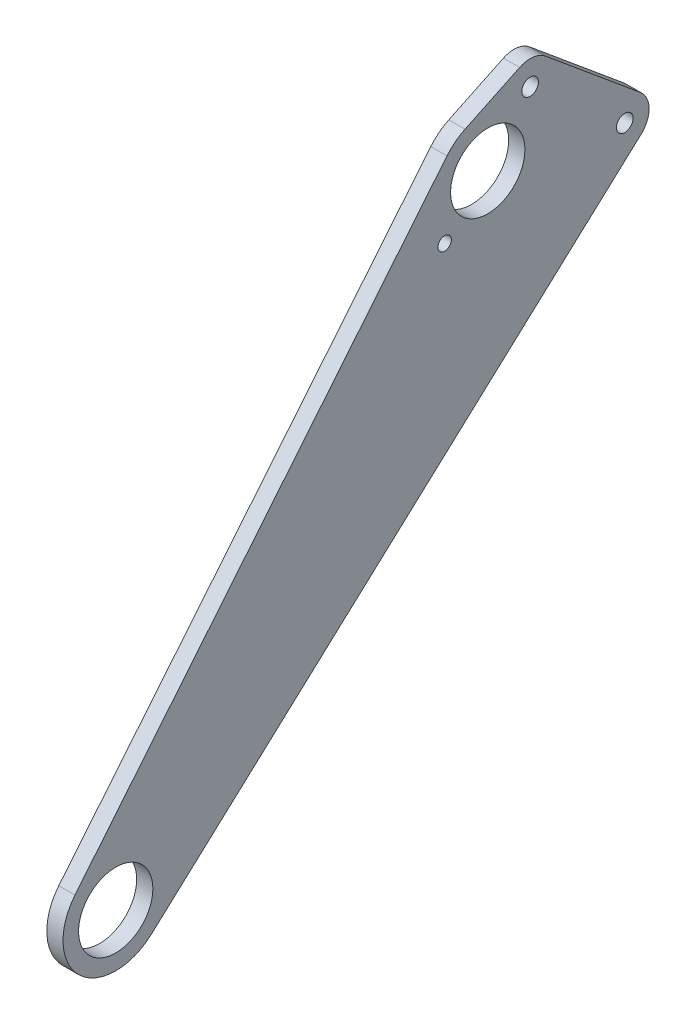
ISO-10303-21;
HEADER;
FILE_DESCRIPTION(('STEP AP214'),'2;1');
FILE_NAME('part.step','',(''),(''),'','','');
FILE_SCHEMA(('AUTOMOTIVE_DESIGN { 1 0 10303 214 1 1 1 1 }'));
ENDSEC;
DATA;
#1=APPLICATION_CONTEXT('core data for automotive mechanical design processes');
#2=APPLICATION_PROTOCOL_DEFINITION('international standard','automotive_design',2000,#1);
#3=PRODUCT_CONTEXT('',#1,'mechanical');
#4=PRODUCT('Part','Part','',(#3));
#5=PRODUCT_RELATED_PRODUCT_CATEGORY('part','',(#4));
#6=PRODUCT_DEFINITION_FORMATION('','',#4);
#7=PRODUCT_DEFINITION_CONTEXT('part definition',#1,'design');
#8=PRODUCT_DEFINITION('design','',#6,#7);
#9=PRODUCT_DEFINITION_SHAPE('','',#8);
#10=(LENGTH_UNIT() NAMED_UNIT(*) SI_UNIT(.MILLI.,.METRE.));
#11=(NAMED_UNIT(*) PLANE_ANGLE_UNIT() SI_UNIT($,.RADIAN.));
#12=(NAMED_UNIT(*) SI_UNIT($,.STERADIAN.) SOLID_ANGLE_UNIT());
#13=UNCERTAINTY_MEASURE_WITH_UNIT(LENGTH_MEASURE(1.E-05),#10,'distance_accuracy_value','');
#14=(GEOMETRIC_REPRESENTATION_CONTEXT(3) GLOBAL_UNCERTAINTY_ASSIGNED_CONTEXT((#13)) GLOBAL_UNIT_ASSIGNED_CONTEXT((#10,
#11,#12)) REPRESENTATION_CONTEXT('',''));
#15=CARTESIAN_POINT('',(0.,0.,0.));
#16=DIRECTION('',(0.,0.,1.));
#17=DIRECTION('',(1.,0.,0.));
#18=AXIS2_PLACEMENT_3D('',#15,#16,#17);
#19=CARTESIAN_POINT('',(6.35,198.172977867795,-162.361236841104));
#20=DIRECTION('',(1.,0.,0.));
#21=DIRECTION('',(0.,0.,-1.));
#22=AXIS2_PLACEMENT_3D('',#19,#20,#21);
#23=PLANE('',#22);
#24=CARTESIAN_POINT('',(6.35,198.172977867795,-162.361236841104));
#25=DIRECTION('',(1.,0.,0.));
#26=DIRECTION('',(0.,0.,-1.));
#27=AXIS2_PLACEMENT_3D('',#24,#25,#26);
#28=CIRCLE('',#27,3.26390000000001);
#29=CARTESIAN_POINT('',(6.35,198.172977867795,-165.625136841104));
#30=VERTEX_POINT('',#29);
#31=EDGE_CURVE('E233',#30,#30,#28,.T.);
#32=ORIENTED_EDGE('',*,*,#31,.F.);
#33=EDGE_LOOP('',(#32));
#34=FACE_BOUND('',#33,.T.);
#35=CARTESIAN_POINT('',(6.35,177.911147809432,-145.760912092819));
#36=DIRECTION('',(1.,0.,0.));
#37=DIRECTION('',(0.,0.,-1.));
#38=AXIS2_PLACEMENT_3D('',#35,#36,#37);
#39=CIRCLE('',#38,14.5542);
#40=CARTESIAN_POINT('',(6.35,177.911147809432,-160.315112092819));
#41=VERTEX_POINT('',#40);
#42=EDGE_CURVE('E217',#41,#41,#39,.T.);
#43=ORIENTED_EDGE('',*,*,#42,.F.);
#44=EDGE_LOOP('',(#43));
#45=FACE_BOUND('',#44,.T.);
#46=CARTESIAN_POINT('',(6.35,198.172977867795,-162.361236841104));
#47=DIRECTION('',(1.,0.,0.));
#48=DIRECTION('',(0.,0.,-1.));
#49=AXIS2_PLACEMENT_3D('',#46,#47,#48);
#50=CIRCLE('',#49,9.52500000000003);
#51=CARTESIAN_POINT('',(6.35,205.497612520881,-168.45019013365));
#52=VERTEX_POINT('',#51);
#53=CARTESIAN_POINT('',(6.35,206.765097737556,-158.250141957298));
#54=VERTEX_POINT('',#53);
#55=EDGE_CURVE('E167',#52,#54,#50,.T.);
#56=ORIENTED_EDGE('',*,*,#55,.T.);
#57=DIRECTION('',(0.,-0.431611011423169,0.902059828846329));
#58=VECTOR('',#57,1.);
#59=CARTESIAN_POINT('',(6.35,196.527407527248,-136.853539844573));
#60=LINE('',#59,#58);
#61=CARTESIAN_POINT('',(6.35,196.527407527248,-136.853539844573));
#62=VERTEX_POINT('',#61);
#63=EDGE_CURVE('E102',#54,#62,#60,.T.);
#64=ORIENTED_EDGE('',*,*,#63,.T.);
#65=CARTESIAN_POINT('',(6.35,177.911147809432,-145.760912092819));
#66=DIRECTION('',(1.,0.,0.));
#67=DIRECTION('',(0.,0.,-1.));
#68=AXIS2_PLACEMENT_3D('',#65,#66,#67);
#69=CIRCLE('',#68,20.6375);
#70=CARTESIAN_POINT('',(6.35,190.990191550505,-129.79704598623));
#71=VERTEX_POINT('',#70);
#72=EDGE_CURVE('E188',#62,#71,#69,.T.);
#73=ORIENTED_EDGE('',*,*,#72,.T.);
#74=DIRECTION('',(0.,-0.773536819216911,0.633751362377852));
#75=VECTOR('',#74,1.);
#76=CARTESIAN_POINT('',(6.35,13.0790437410729,15.963866106589));
#77=LINE('',#76,#75);
#78=CARTESIAN_POINT('',(6.35,13.0790437410729,15.963866106589));
#79=VERTEX_POINT('',#78);
#80=EDGE_CURVE('E202',#71,#79,#77,.T.);
#81=ORIENTED_EDGE('',*,*,#80,.T.);
#82=CARTESIAN_POINT('',(6.35,0.,0.));
#83=DIRECTION('',(1.,0.,0.));
#84=DIRECTION('',(0.,0.,1.));
#85=AXIS2_PLACEMENT_3D('',#82,#83,#84);
#86=CIRCLE('',#85,20.6375);
#87=CARTESIAN_POINT('',(6.35,-15.2286231200556,-13.9282247295665));
#88=VERTEX_POINT('',#87);
#89=EDGE_CURVE('E121',#79,#88,#86,.T.);
#90=ORIENTED_EDGE('',*,*,#89,.T.);
#91=DIRECTION('',(0.,0.674898836078329,-0.737910266265565));
#92=VECTOR('',#91,1.);
#93=CARTESIAN_POINT('',(6.35,160.321158895711,-205.868082179672));
#94=LINE('',#93,#92);
#95=CARTESIAN_POINT('',(6.35,160.321158895711,-205.868082179672));
#96=VERTEX_POINT('',#95);
#97=EDGE_CURVE('E115',#88,#96,#94,.T.);
#98=ORIENTED_EDGE('',*,*,#97,.T.);
#99=CARTESIAN_POINT('',(6.35,167.349754181891,-199.439670766026));
#100=DIRECTION('',(1.,0.,0.));
#101=DIRECTION('',(0.,0.,-1.));
#102=AXIS2_PLACEMENT_3D('',#99,#100,#101);
#103=CIRCLE('',#102,9.52499999999997);
#104=CARTESIAN_POINT('',(6.35,174.674388834977,-205.528624058572));
#105=VERTEX_POINT('',#104);
#106=EDGE_CURVE('E119',#96,#105,#103,.T.);
#107=ORIENTED_EDGE('',*,*,#106,.T.);
#108=DIRECTION('',(0.,0.639260188193809,0.768990514759718));
#109=VECTOR('',#108,1.);
#110=CARTESIAN_POINT('',(6.35,205.497612520881,-168.45019013365));
#111=LINE('',#110,#109);
#112=EDGE_CURVE('E59',#105,#52,#111,.T.);
#113=ORIENTED_EDGE('',*,*,#112,.T.);
#114=EDGE_LOOP('',(#56,#64,#73,#81,#90,#98,#107,#113));
#115=FACE_BOUND('',#114,.T.);
#116=CARTESIAN_POINT('',(6.35,0.,0.));
#117=DIRECTION('',(1.,0.,0.));
#118=DIRECTION('',(0.,0.,-1.));
#119=AXIS2_PLACEMENT_3D('',#116,#117,#118);
#120=CIRCLE('',#119,14.5542);
#121=CARTESIAN_POINT('',(6.35,0.,-14.5542));
#122=VERTEX_POINT('',#121);
#123=EDGE_CURVE('E149',#122,#122,#120,.T.);
#124=ORIENTED_EDGE('',*,*,#123,.F.);
#125=EDGE_LOOP('',(#124));
#126=FACE_BOUND('',#125,.T.);
#127=CARTESIAN_POINT('',(6.35,167.349754181891,-199.439670766026));
#128=DIRECTION('',(1.,0.,0.));
#129=DIRECTION('',(0.,0.,-1.));
#130=AXIS2_PLACEMENT_3D('',#127,#128,#129);
#131=CIRCLE('',#130,3.26389999999998);
#132=CARTESIAN_POINT('',(6.35,167.349754181891,-202.703570766026));
#133=VERTEX_POINT('',#132);
#134=EDGE_CURVE('E225',#133,#133,#131,.T.);
#135=ORIENTED_EDGE('',*,*,#134,.F.);
#136=EDGE_LOOP('',(#135));
#137=FACE_BOUND('',#136,.T.);
#138=CARTESIAN_POINT('',(6.35,161.759110908321,-128.87664859259));
#139=DIRECTION('',(1.,0.,0.));
#140=DIRECTION('',(0.,0.,-1.));
#141=AXIS2_PLACEMENT_3D('',#138,#139,#140);
#142=CIRCLE('',#141,2.62889999999999);
#143=CARTESIAN_POINT('',(6.35,161.759110908321,-131.50554859259));
#144=VERTEX_POINT('',#143);
#145=EDGE_CURVE('E241',#144,#144,#142,.T.);
#146=ORIENTED_EDGE('',*,*,#145,.F.);
#147=EDGE_LOOP('',(#146));
#148=FACE_BOUND('',#147,.T.);
#149=ADVANCED_FACE('F41',(#34,#45,#115,#126,#137,#148),#23,.T.);
#150=CARTESIAN_POINT('',(0.,198.172977867795,-162.361236841104));
#151=DIRECTION('',(1.,0.,0.));
#152=DIRECTION('',(0.,0.,-1.));
#153=AXIS2_PLACEMENT_3D('',#150,#151,#152);
#154=PLANE('',#153);
#155=CARTESIAN_POINT('',(0.,198.172977867795,-162.361236841104));
#156=DIRECTION('',(1.,0.,0.));
#157=DIRECTION('',(0.,0.,-1.));
#158=AXIS2_PLACEMENT_3D('',#155,#156,#157);
#159=CIRCLE('',#158,9.52500000000003);
#160=CARTESIAN_POINT('',(0.,205.497612520881,-168.45019013365));
#161=VERTEX_POINT('',#160);
#162=CARTESIAN_POINT('',(0.,206.765097737556,-158.250141957298));
#163=VERTEX_POINT('',#162);
#164=EDGE_CURVE('E144',#161,#163,#159,.T.);
#165=ORIENTED_EDGE('',*,*,#164,.F.);
#166=DIRECTION('',(0.,0.639260188193809,0.768990514759718));
#167=VECTOR('',#166,1.);
#168=CARTESIAN_POINT('',(0.,205.497612520881,-168.45019013365));
#169=LINE('',#168,#167);
#170=CARTESIAN_POINT('',(0.,174.674388834977,-205.528624058572));
#171=VERTEX_POINT('',#170);
#172=EDGE_CURVE('E94',#171,#161,#169,.T.);
#173=ORIENTED_EDGE('',*,*,#172,.F.);
#174=CARTESIAN_POINT('',(0.,167.349754181891,-199.439670766026));
#175=DIRECTION('',(1.,0.,0.));
#176=DIRECTION('',(0.,0.,-1.));
#177=AXIS2_PLACEMENT_3D('',#174,#175,#176);
#178=CIRCLE('',#177,9.52499999999997);
#179=CARTESIAN_POINT('',(0.,160.321158895711,-205.868082179672));
#180=VERTEX_POINT('',#179);
#181=EDGE_CURVE('E88',#180,#171,#178,.T.);
#182=ORIENTED_EDGE('',*,*,#181,.F.);
#183=DIRECTION('',(0.,0.674898836078329,-0.737910266265565));
#184=VECTOR('',#183,1.);
#185=CARTESIAN_POINT('',(0.,160.321158895711,-205.868082179672));
#186=LINE('',#185,#184);
#187=CARTESIAN_POINT('',(0.,-15.2286231200556,-13.9282247295665));
#188=VERTEX_POINT('',#187);
#189=EDGE_CURVE('E130',#188,#180,#186,.T.);
#190=ORIENTED_EDGE('',*,*,#189,.F.);
#191=CARTESIAN_POINT('',(0.,0.,0.));
#192=DIRECTION('',(1.,0.,0.));
#193=DIRECTION('',(0.,0.,1.));
#194=AXIS2_PLACEMENT_3D('',#191,#192,#193);
#195=CIRCLE('',#194,20.6375);
#196=CARTESIAN_POINT('',(0.,13.0790437410729,15.963866106589));
#197=VERTEX_POINT('',#196);
#198=EDGE_CURVE('E158',#197,#188,#195,.T.);
#199=ORIENTED_EDGE('',*,*,#198,.F.);
#200=DIRECTION('',(0.,-0.773536819216911,0.633751362377852));
#201=VECTOR('',#200,1.);
#202=CARTESIAN_POINT('',(0.,13.0790437410729,15.963866106589));
#203=LINE('',#202,#201);
#204=CARTESIAN_POINT('',(0.,190.990191550505,-129.79704598623));
#205=VERTEX_POINT('',#204);
#206=EDGE_CURVE('E155',#205,#197,#203,.T.);
#207=ORIENTED_EDGE('',*,*,#206,.F.);
#208=CARTESIAN_POINT('',(0.,177.911147809432,-145.760912092819));
#209=DIRECTION('',(1.,0.,0.));
#210=DIRECTION('',(0.,0.,-1.));
#211=AXIS2_PLACEMENT_3D('',#208,#209,#210);
#212=CIRCLE('',#211,20.6375);
#213=CARTESIAN_POINT('',(0.,196.527407527248,-136.853539844573));
#214=VERTEX_POINT('',#213);
#215=EDGE_CURVE('E152',#214,#205,#212,.T.);
#216=ORIENTED_EDGE('',*,*,#215,.F.);
#217=DIRECTION('',(0.,-0.431611011423169,0.902059828846329));
#218=VECTOR('',#217,1.);
#219=CARTESIAN_POINT('',(0.,196.527407527248,-136.853539844573));
#220=LINE('',#219,#218);
#221=EDGE_CURVE('E148',#163,#214,#220,.T.);
#222=ORIENTED_EDGE('',*,*,#221,.F.);
#223=EDGE_LOOP('',(#165,#173,#182,#190,#199,#207,#216,#222));
#224=FACE_BOUND('',#223,.T.);
#225=CARTESIAN_POINT('',(0.,0.,0.));
#226=DIRECTION('',(1.,0.,0.));
#227=DIRECTION('',(0.,0.,-1.));
#228=AXIS2_PLACEMENT_3D('',#225,#226,#227);
#229=CIRCLE('',#228,14.5542);
#230=CARTESIAN_POINT('',(0.,0.,-14.5542));
#231=VERTEX_POINT('',#230);
#232=EDGE_CURVE('E213',#231,#231,#229,.T.);
#233=ORIENTED_EDGE('',*,*,#232,.T.);
#234=EDGE_LOOP('',(#233));
#235=FACE_BOUND('',#234,.T.);
#236=CARTESIAN_POINT('',(0.,177.911147809432,-145.760912092819));
#237=DIRECTION('',(1.,0.,0.));
#238=DIRECTION('',(0.,0.,-1.));
#239=AXIS2_PLACEMENT_3D('',#236,#237,#238);
#240=CIRCLE('',#239,14.5542);
#241=CARTESIAN_POINT('',(0.,177.911147809432,-160.315112092819));
#242=VERTEX_POINT('',#241);
#243=EDGE_CURVE('E221',#242,#242,#240,.T.);
#244=ORIENTED_EDGE('',*,*,#243,.T.);
#245=EDGE_LOOP('',(#244));
#246=FACE_BOUND('',#245,.T.);
#247=CARTESIAN_POINT('',(0.,167.349754181891,-199.439670766026));
#248=DIRECTION('',(1.,0.,0.));
#249=DIRECTION('',(0.,0.,-1.));
#250=AXIS2_PLACEMENT_3D('',#247,#248,#249);
#251=CIRCLE('',#250,3.26389999999998);
#252=CARTESIAN_POINT('',(0.,167.349754181891,-202.703570766026));
#253=VERTEX_POINT('',#252);
#254=EDGE_CURVE('E229',#253,#253,#251,.T.);
#255=ORIENTED_EDGE('',*,*,#254,.T.);
#256=EDGE_LOOP('',(#255));
#257=FACE_BOUND('',#256,.T.);
#258=CARTESIAN_POINT('',(0.,198.172977867795,-162.361236841104));
#259=DIRECTION('',(1.,0.,0.));
#260=DIRECTION('',(0.,0.,-1.));
#261=AXIS2_PLACEMENT_3D('',#258,#259,#260);
#262=CIRCLE('',#261,3.26390000000001);
#263=CARTESIAN_POINT('',(0.,198.172977867795,-165.625136841104));
#264=VERTEX_POINT('',#263);
#265=EDGE_CURVE('E237',#264,#264,#262,.T.);
#266=ORIENTED_EDGE('',*,*,#265,.T.);
#267=EDGE_LOOP('',(#266));
#268=FACE_BOUND('',#267,.T.);
#269=CARTESIAN_POINT('',(0.,161.759110908321,-128.87664859259));
#270=DIRECTION('',(1.,0.,0.));
#271=DIRECTION('',(0.,0.,-1.));
#272=AXIS2_PLACEMENT_3D('',#269,#270,#271);
#273=CIRCLE('',#272,2.62889999999999);
#274=CARTESIAN_POINT('',(0.,161.759110908321,-131.50554859259));
#275=VERTEX_POINT('',#274);
#276=EDGE_CURVE('E245',#275,#275,#273,.T.);
#277=ORIENTED_EDGE('',*,*,#276,.T.);
#278=EDGE_LOOP('',(#277));
#279=FACE_BOUND('',#278,.T.);
#280=ADVANCED_FACE('F192',(#224,#235,#246,#257,#268,#279),#154,.F.);
#281=CARTESIAN_POINT('',(6.35,198.172977867795,-162.361236841104));
#282=DIRECTION('',(-1.,0.,0.));
#283=DIRECTION('',(0.,0.,1.));
#284=AXIS2_PLACEMENT_3D('',#281,#282,#283);
#285=CYLINDRICAL_SURFACE('',#284,9.52500000000003);
#286=ORIENTED_EDGE('',*,*,#164,.T.);
#287=DIRECTION('',(-1.,0.,0.));
#288=VECTOR('',#287,1.);
#289=CARTESIAN_POINT('',(6.35,206.765097737556,-158.250141957298));
#290=LINE('',#289,#288);
#291=EDGE_CURVE('E11',#54,#163,#290,.T.);
#292=ORIENTED_EDGE('',*,*,#291,.F.);
#293=ORIENTED_EDGE('',*,*,#55,.F.);
#294=DIRECTION('',(-1.,0.,0.));
#295=VECTOR('',#294,1.);
#296=CARTESIAN_POINT('',(6.35,205.497612520881,-168.45019013365));
#297=LINE('',#296,#295);
#298=EDGE_CURVE('E140',#52,#161,#297,.T.);
#299=ORIENTED_EDGE('',*,*,#298,.T.);
#300=EDGE_LOOP('',(#286,#292,#293,#299));
#301=FACE_BOUND('',#300,.T.);
#302=ADVANCED_FACE('F43',(#301),#285,.T.);
#303=CARTESIAN_POINT('',(6.35,196.527407527248,-136.853539844573));
#304=DIRECTION('',(0.,-0.90205982884633,-0.431611011423169));
#305=DIRECTION('',(0.,0.431611011423169,-0.90205982884633));
#306=AXIS2_PLACEMENT_3D('',#303,#304,#305);
#307=PLANE('',#306);
#308=ORIENTED_EDGE('',*,*,#221,.T.);
#309=DIRECTION('',(-1.,0.,0.));
#310=VECTOR('',#309,1.);
#311=CARTESIAN_POINT('',(6.35,196.527407527248,-136.853539844573));
#312=LINE('',#311,#310);
#313=EDGE_CURVE('E51',#62,#214,#312,.T.);
#314=ORIENTED_EDGE('',*,*,#313,.F.);
#315=ORIENTED_EDGE('',*,*,#63,.F.);
#316=ORIENTED_EDGE('',*,*,#291,.T.);
#317=EDGE_LOOP('',(#308,#314,#315,#316));
#318=FACE_BOUND('',#317,.T.);
#319=ADVANCED_FACE('F281',(#318),#307,.F.);
#320=CARTESIAN_POINT('',(6.35,177.911147809432,-145.760912092819));
#321=DIRECTION('',(-1.,0.,0.));
#322=DIRECTION('',(0.,0.,1.));
#323=AXIS2_PLACEMENT_3D('',#320,#321,#322);
#324=CYLINDRICAL_SURFACE('',#323,20.6375);
#325=ORIENTED_EDGE('',*,*,#215,.T.);
#326=DIRECTION('',(-1.,0.,0.));
#327=VECTOR('',#326,1.);
#328=CARTESIAN_POINT('',(6.35,190.990191550505,-129.79704598623));
#329=LINE('',#328,#327);
#330=EDGE_CURVE('E178',#71,#205,#329,.T.);
#331=ORIENTED_EDGE('',*,*,#330,.F.);
#332=ORIENTED_EDGE('',*,*,#72,.F.);
#333=ORIENTED_EDGE('',*,*,#313,.T.);
#334=EDGE_LOOP('',(#325,#331,#332,#333));
#335=FACE_BOUND('',#334,.T.);
#336=ADVANCED_FACE('F186',(#335),#324,.T.);
#337=CARTESIAN_POINT('',(6.35,13.0790437410729,15.963866106589));
#338=DIRECTION('',(0.,-0.633751362377852,-0.773536819216911));
#339=DIRECTION('',(0.,0.773536819216911,-0.633751362377852));
#340=AXIS2_PLACEMENT_3D('',#337,#338,#339);
#341=PLANE('',#340);
#342=ORIENTED_EDGE('',*,*,#206,.T.);
#343=DIRECTION('',(-1.,0.,0.));
#344=VECTOR('',#343,1.);
#345=CARTESIAN_POINT('',(6.35,13.0790437410729,15.963866106589));
#346=LINE('',#345,#344);
#347=EDGE_CURVE('E174',#79,#197,#346,.T.);
#348=ORIENTED_EDGE('',*,*,#347,.F.);
#349=ORIENTED_EDGE('',*,*,#80,.F.);
#350=ORIENTED_EDGE('',*,*,#330,.T.);
#351=EDGE_LOOP('',(#342,#348,#349,#350));
#352=FACE_BOUND('',#351,.T.);
#353=ADVANCED_FACE('F197',(#352),#341,.F.);
#354=CARTESIAN_POINT('',(6.35,0.,0.));
#355=DIRECTION('',(-1.,0.,0.));
#356=DIRECTION('',(0.,0.,1.));
#357=AXIS2_PLACEMENT_3D('',#354,#355,#356);
#358=CYLINDRICAL_SURFACE('',#357,20.6375);
#359=ORIENTED_EDGE('',*,*,#198,.T.);
#360=DIRECTION('',(-1.,0.,0.));
#361=VECTOR('',#360,1.);
#362=CARTESIAN_POINT('',(6.35,-15.2286231200556,-13.9282247295665));
#363=LINE('',#362,#361);
#364=EDGE_CURVE('E132',#88,#188,#363,.T.);
#365=ORIENTED_EDGE('',*,*,#364,.F.);
#366=ORIENTED_EDGE('',*,*,#89,.F.);
#367=ORIENTED_EDGE('',*,*,#347,.T.);
#368=EDGE_LOOP('',(#359,#365,#366,#367));
#369=FACE_BOUND('',#368,.T.);
#370=ADVANCED_FACE('F200',(#369),#358,.T.);
#371=CARTESIAN_POINT('',(6.35,160.321158895711,-205.868082179672));
#372=DIRECTION('',(0.,0.737910266265565,0.674898836078329));
#373=DIRECTION('',(0.,-0.674898836078329,0.737910266265565));
#374=AXIS2_PLACEMENT_3D('',#371,#372,#373);
#375=PLANE('',#374);
#376=ORIENTED_EDGE('',*,*,#189,.T.);
#377=DIRECTION('',(-1.,0.,0.));
#378=VECTOR('',#377,1.);
#379=CARTESIAN_POINT('',(6.35,160.321158895711,-205.868082179672));
#380=LINE('',#379,#378);
#381=EDGE_CURVE('E127',#96,#180,#380,.T.);
#382=ORIENTED_EDGE('',*,*,#381,.F.);
#383=ORIENTED_EDGE('',*,*,#97,.F.);
#384=ORIENTED_EDGE('',*,*,#364,.T.);
#385=EDGE_LOOP('',(#376,#382,#383,#384));
#386=FACE_BOUND('',#385,.T.);
#387=ADVANCED_FACE('F128',(#386),#375,.F.);
#388=CARTESIAN_POINT('',(6.35,167.349754181891,-199.439670766026));
#389=DIRECTION('',(-1.,0.,0.));
#390=DIRECTION('',(0.,0.,1.));
#391=AXIS2_PLACEMENT_3D('',#388,#389,#390);
#392=CYLINDRICAL_SURFACE('',#391,9.52499999999997);
#393=ORIENTED_EDGE('',*,*,#181,.T.);
#394=DIRECTION('',(-1.,0.,0.));
#395=VECTOR('',#394,1.);
#396=CARTESIAN_POINT('',(6.35,174.674388834977,-205.528624058572));
#397=LINE('',#396,#395);
#398=EDGE_CURVE('E133',#105,#171,#397,.T.);
#399=ORIENTED_EDGE('',*,*,#398,.F.);
#400=ORIENTED_EDGE('',*,*,#106,.F.);
#401=ORIENTED_EDGE('',*,*,#381,.T.);
#402=EDGE_LOOP('',(#393,#399,#400,#401));
#403=FACE_BOUND('',#402,.T.);
#404=ADVANCED_FACE('F135',(#403),#392,.T.);
#405=CARTESIAN_POINT('',(6.35,205.497612520881,-168.45019013365));
#406=DIRECTION('',(0.,-0.768990514759718,0.639260188193809));
#407=DIRECTION('',(0.,-0.639260188193809,-0.768990514759718));
#408=AXIS2_PLACEMENT_3D('',#405,#406,#407);
#409=PLANE('',#408);
#410=ORIENTED_EDGE('',*,*,#172,.T.);
#411=ORIENTED_EDGE('',*,*,#298,.F.);
#412=ORIENTED_EDGE('',*,*,#112,.F.);
#413=ORIENTED_EDGE('',*,*,#398,.T.);
#414=EDGE_LOOP('',(#410,#411,#412,#413));
#415=FACE_BOUND('',#414,.T.);
#416=ADVANCED_FACE('F269',(#415),#409,.F.);
#417=CARTESIAN_POINT('',(6.35,0.,0.));
#418=DIRECTION('',(-1.,0.,0.));
#419=DIRECTION('',(0.,0.,1.));
#420=AXIS2_PLACEMENT_3D('',#417,#418,#419);
#421=CYLINDRICAL_SURFACE('',#420,14.5542);
#422=ORIENTED_EDGE('',*,*,#123,.T.);
#423=EDGE_LOOP('',(#422));
#424=FACE_BOUND('',#423,.T.);
#425=ORIENTED_EDGE('',*,*,#232,.F.);
#426=EDGE_LOOP('',(#425));
#427=FACE_BOUND('',#426,.T.);
#428=ADVANCED_FACE('F266',(#424,#427),#421,.F.);
#429=CARTESIAN_POINT('',(6.35,177.911147809432,-145.760912092819));
#430=DIRECTION('',(-1.,0.,0.));
#431=DIRECTION('',(0.,0.,1.));
#432=AXIS2_PLACEMENT_3D('',#429,#430,#431);
#433=CYLINDRICAL_SURFACE('',#432,14.5542);
#434=ORIENTED_EDGE('',*,*,#42,.T.);
#435=EDGE_LOOP('',(#434));
#436=FACE_BOUND('',#435,.T.);
#437=ORIENTED_EDGE('',*,*,#243,.F.);
#438=EDGE_LOOP('',(#437));
#439=FACE_BOUND('',#438,.T.);
#440=ADVANCED_FACE('F323',(#436,#439),#433,.F.);
#441=CARTESIAN_POINT('',(6.35,167.349754181891,-199.439670766026));
#442=DIRECTION('',(-1.,0.,0.));
#443=DIRECTION('',(0.,0.,1.));
#444=AXIS2_PLACEMENT_3D('',#441,#442,#443);
#445=CYLINDRICAL_SURFACE('',#444,3.26389999999998);
#446=ORIENTED_EDGE('',*,*,#134,.T.);
#447=EDGE_LOOP('',(#446));
#448=FACE_BOUND('',#447,.T.);
#449=ORIENTED_EDGE('',*,*,#254,.F.);
#450=EDGE_LOOP('',(#449));
#451=FACE_BOUND('',#450,.T.);
#452=ADVANCED_FACE('F334',(#448,#451),#445,.F.);
#453=CARTESIAN_POINT('',(6.35,198.172977867795,-162.361236841104));
#454=DIRECTION('',(-1.,0.,0.));
#455=DIRECTION('',(0.,0.,1.));
#456=AXIS2_PLACEMENT_3D('',#453,#454,#455);
#457=CYLINDRICAL_SURFACE('',#456,3.26390000000001);
#458=ORIENTED_EDGE('',*,*,#31,.T.);
#459=EDGE_LOOP('',(#458));
#460=FACE_BOUND('',#459,.T.);
#461=ORIENTED_EDGE('',*,*,#265,.F.);
#462=EDGE_LOOP('',(#461));
#463=FACE_BOUND('',#462,.T.);
#464=ADVANCED_FACE('F341',(#460,#463),#457,.F.);
#465=CARTESIAN_POINT('',(6.35,161.759110908321,-128.87664859259));
#466=DIRECTION('',(-1.,0.,0.));
#467=DIRECTION('',(0.,0.,1.));
#468=AXIS2_PLACEMENT_3D('',#465,#466,#467);
#469=CYLINDRICAL_SURFACE('',#468,2.62889999999999);
#470=ORIENTED_EDGE('',*,*,#145,.T.);
#471=EDGE_LOOP('',(#470));
#472=FACE_BOUND('',#471,.T.);
#473=ORIENTED_EDGE('',*,*,#276,.F.);
#474=EDGE_LOOP('',(#473));
#475=FACE_BOUND('',#474,.T.);
#476=ADVANCED_FACE('F253',(#472,#475),#469,.F.);
#477=CLOSED_SHELL('',(#149,#280,#302,#319,#336,#353,#370,#387,#404,#416,#428,#440,#452,#464,#476));
#478=MANIFOLD_SOLID_BREP('B2',#477);
#479=ADVANCED_BREP_SHAPE_REPRESENTATION('',(#18,#478),#14);
#480=SHAPE_DEFINITION_REPRESENTATION(#9,#479);
ENDSEC;
END-ISO-10303-21;
